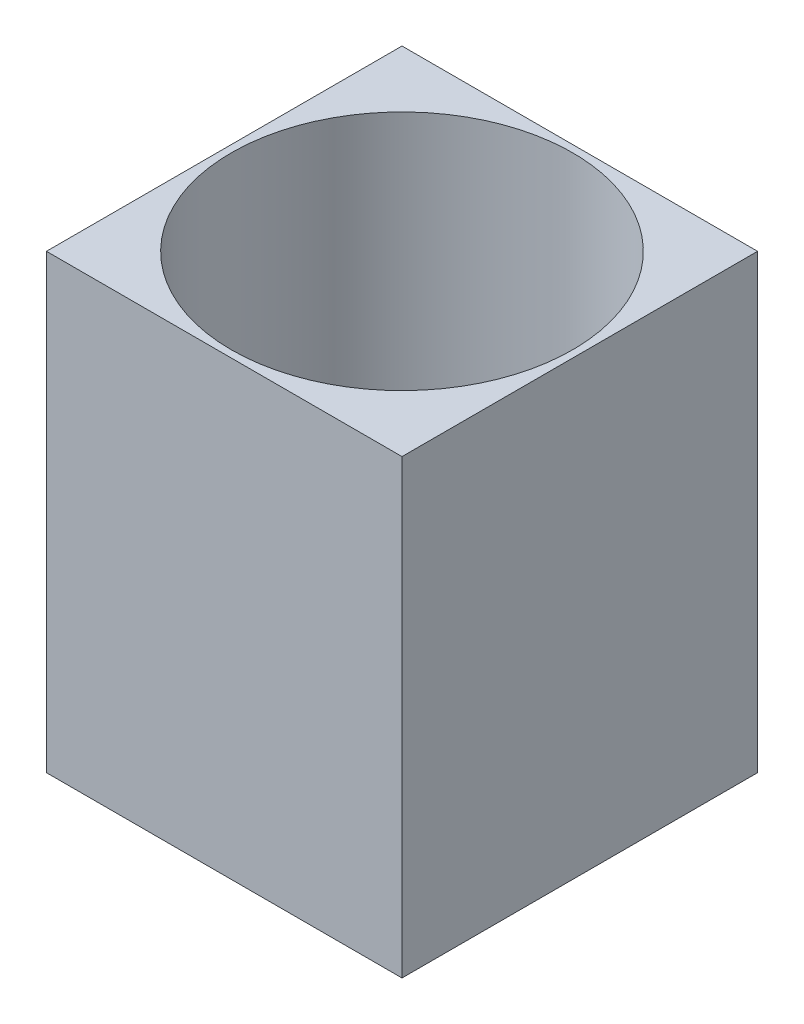
ISO-10303-21;
HEADER;
FILE_DESCRIPTION(('STEP AP214'),'2;1');
FILE_NAME('part.step','',(''),(''),'','','');
FILE_SCHEMA(('AUTOMOTIVE_DESIGN { 1 0 10303 214 1 1 1 1 }'));
ENDSEC;
DATA;
#1=APPLICATION_CONTEXT('core data for automotive mechanical design processes');
#2=APPLICATION_PROTOCOL_DEFINITION('international standard','automotive_design',2000,#1);
#3=PRODUCT_CONTEXT('',#1,'mechanical');
#4=PRODUCT('Part','Part','',(#3));
#5=PRODUCT_RELATED_PRODUCT_CATEGORY('part','',(#4));
#6=PRODUCT_DEFINITION_FORMATION('','',#4);
#7=PRODUCT_DEFINITION_CONTEXT('part definition',#1,'design');
#8=PRODUCT_DEFINITION('design','',#6,#7);
#9=PRODUCT_DEFINITION_SHAPE('','',#8);
#10=(LENGTH_UNIT() NAMED_UNIT(*) SI_UNIT(.MILLI.,.METRE.));
#11=(NAMED_UNIT(*) PLANE_ANGLE_UNIT() SI_UNIT($,.RADIAN.));
#12=(NAMED_UNIT(*) SI_UNIT($,.STERADIAN.) SOLID_ANGLE_UNIT());
#13=UNCERTAINTY_MEASURE_WITH_UNIT(LENGTH_MEASURE(1.E-05),#10,'distance_accuracy_value','');
#14=(GEOMETRIC_REPRESENTATION_CONTEXT(3) GLOBAL_UNCERTAINTY_ASSIGNED_CONTEXT((#13)) GLOBAL_UNIT_ASSIGNED_CONTEXT((#10,
#11,#12)) REPRESENTATION_CONTEXT('',''));
#15=CARTESIAN_POINT('',(0.,0.,0.));
#16=DIRECTION('',(0.,0.,1.));
#17=DIRECTION('',(1.,0.,0.));
#18=AXIS2_PLACEMENT_3D('',#15,#16,#17);
#19=CARTESIAN_POINT('',(0.,6.35,0.));
#20=DIRECTION('',(0.,-1.,0.));
#21=DIRECTION('',(0.,0.,-1.));
#22=AXIS2_PLACEMENT_3D('',#19,#20,#21);
#23=PLANE('',#22);
#24=DIRECTION('',(0.,0.,1.));
#25=VECTOR('',#24,1.);
#26=CARTESIAN_POINT('',(0.,6.35,0.));
#27=LINE('',#26,#25);
#28=CARTESIAN_POINT('',(0.,6.35,-5.));
#29=VERTEX_POINT('',#28);
#30=CARTESIAN_POINT('',(0.,6.35,0.));
#31=VERTEX_POINT('',#30);
#32=EDGE_CURVE('E95',#29,#31,#27,.T.);
#33=ORIENTED_EDGE('',*,*,#32,.T.);
#34=DIRECTION('',(1.,0.,0.));
#35=VECTOR('',#34,1.);
#36=CARTESIAN_POINT('',(0.,6.35,0.));
#37=LINE('',#36,#35);
#38=CARTESIAN_POINT('',(5.,6.35,0.));
#39=VERTEX_POINT('',#38);
#40=EDGE_CURVE('E90',#31,#39,#37,.T.);
#41=ORIENTED_EDGE('',*,*,#40,.T.);
#42=DIRECTION('',(0.,0.,-1.));
#43=VECTOR('',#42,1.);
#44=CARTESIAN_POINT('',(5.,6.35,0.));
#45=LINE('',#44,#43);
#46=CARTESIAN_POINT('',(5.,6.35,-5.));
#47=VERTEX_POINT('',#46);
#48=EDGE_CURVE('E93',#39,#47,#45,.T.);
#49=ORIENTED_EDGE('',*,*,#48,.T.);
#50=DIRECTION('',(-1.,0.,0.));
#51=VECTOR('',#50,1.);
#52=CARTESIAN_POINT('',(0.,6.35,-5.));
#53=LINE('',#52,#51);
#54=EDGE_CURVE('E60',#47,#29,#53,.T.);
#55=ORIENTED_EDGE('',*,*,#54,.T.);
#56=EDGE_LOOP('',(#33,#41,#49,#55));
#57=FACE_BOUND('',#56,.T.);
#58=CARTESIAN_POINT('',(2.5,6.35,-2.5));
#59=DIRECTION('',(0.,1.,0.));
#60=DIRECTION('',(0.,0.,1.));
#61=AXIS2_PLACEMENT_3D('',#58,#59,#60);
#62=CIRCLE('',#61,2.4);
#63=CARTESIAN_POINT('',(2.5,6.35,-0.1));
#64=VERTEX_POINT('',#63);
#65=EDGE_CURVE('E115',#64,#64,#62,.T.);
#66=ORIENTED_EDGE('',*,*,#65,.F.);
#67=EDGE_LOOP('',(#66));
#68=FACE_BOUND('',#67,.T.);
#69=ADVANCED_FACE('F42',(#57,#68),#23,.F.);
#70=CARTESIAN_POINT('',(0.,0.,0.));
#71=DIRECTION('',(0.,-1.,0.));
#72=DIRECTION('',(0.,0.,-1.));
#73=AXIS2_PLACEMENT_3D('',#70,#71,#72);
#74=PLANE('',#73);
#75=DIRECTION('',(0.,0.,1.));
#76=VECTOR('',#75,1.);
#77=CARTESIAN_POINT('',(0.,0.,0.));
#78=LINE('',#77,#76);
#79=CARTESIAN_POINT('',(0.,0.,-5.));
#80=VERTEX_POINT('',#79);
#81=CARTESIAN_POINT('',(0.,0.,0.));
#82=VERTEX_POINT('',#81);
#83=EDGE_CURVE('E111',#80,#82,#78,.T.);
#84=ORIENTED_EDGE('',*,*,#83,.F.);
#85=DIRECTION('',(-1.,0.,0.));
#86=VECTOR('',#85,1.);
#87=CARTESIAN_POINT('',(0.,0.,-5.));
#88=LINE('',#87,#86);
#89=CARTESIAN_POINT('',(5.,0.,-5.));
#90=VERTEX_POINT('',#89);
#91=EDGE_CURVE('E83',#90,#80,#88,.T.);
#92=ORIENTED_EDGE('',*,*,#91,.F.);
#93=DIRECTION('',(0.,0.,-1.));
#94=VECTOR('',#93,1.);
#95=CARTESIAN_POINT('',(5.,0.,0.));
#96=LINE('',#95,#94);
#97=CARTESIAN_POINT('',(5.,0.,0.));
#98=VERTEX_POINT('',#97);
#99=EDGE_CURVE('E77',#98,#90,#96,.T.);
#100=ORIENTED_EDGE('',*,*,#99,.F.);
#101=DIRECTION('',(1.,0.,0.));
#102=VECTOR('',#101,1.);
#103=CARTESIAN_POINT('',(0.,0.,0.));
#104=LINE('',#103,#102);
#105=EDGE_CURVE('E100',#82,#98,#104,.T.);
#106=ORIENTED_EDGE('',*,*,#105,.F.);
#107=EDGE_LOOP('',(#84,#92,#100,#106));
#108=FACE_BOUND('',#107,.T.);
#109=CARTESIAN_POINT('',(2.5,0.,-2.5));
#110=DIRECTION('',(0.,1.,0.));
#111=DIRECTION('',(0.,0.,1.));
#112=AXIS2_PLACEMENT_3D('',#109,#110,#111);
#113=CIRCLE('',#112,2.4);
#114=CARTESIAN_POINT('',(2.5,0.,-0.1));
#115=VERTEX_POINT('',#114);
#116=EDGE_CURVE('E133',#115,#115,#113,.T.);
#117=ORIENTED_EDGE('',*,*,#116,.T.);
#118=EDGE_LOOP('',(#117));
#119=FACE_BOUND('',#118,.T.);
#120=ADVANCED_FACE('F128',(#108,#119),#74,.T.);
#121=CARTESIAN_POINT('',(0.,6.35,0.));
#122=DIRECTION('',(1.,0.,0.));
#123=DIRECTION('',(0.,0.,-1.));
#124=AXIS2_PLACEMENT_3D('',#121,#122,#123);
#125=PLANE('',#124);
#126=ORIENTED_EDGE('',*,*,#83,.T.);
#127=DIRECTION('',(0.,-1.,0.));
#128=VECTOR('',#127,1.);
#129=CARTESIAN_POINT('',(0.,6.35,0.));
#130=LINE('',#129,#128);
#131=EDGE_CURVE('E11',#31,#82,#130,.T.);
#132=ORIENTED_EDGE('',*,*,#131,.F.);
#133=ORIENTED_EDGE('',*,*,#32,.F.);
#134=DIRECTION('',(0.,-1.,0.));
#135=VECTOR('',#134,1.);
#136=CARTESIAN_POINT('',(0.,6.35,-5.));
#137=LINE('',#136,#135);
#138=EDGE_CURVE('E107',#29,#80,#137,.T.);
#139=ORIENTED_EDGE('',*,*,#138,.T.);
#140=EDGE_LOOP('',(#126,#132,#133,#139));
#141=FACE_BOUND('',#140,.T.);
#142=ADVANCED_FACE('F44',(#141),#125,.F.);
#143=CARTESIAN_POINT('',(0.,6.35,0.));
#144=DIRECTION('',(0.,0.,-1.));
#145=DIRECTION('',(-1.,0.,0.));
#146=AXIS2_PLACEMENT_3D('',#143,#144,#145);
#147=PLANE('',#146);
#148=ORIENTED_EDGE('',*,*,#105,.T.);
#149=DIRECTION('',(0.,-1.,0.));
#150=VECTOR('',#149,1.);
#151=CARTESIAN_POINT('',(5.,6.35,0.));
#152=LINE('',#151,#150);
#153=EDGE_CURVE('E52',#39,#98,#152,.T.);
#154=ORIENTED_EDGE('',*,*,#153,.F.);
#155=ORIENTED_EDGE('',*,*,#40,.F.);
#156=ORIENTED_EDGE('',*,*,#131,.T.);
#157=EDGE_LOOP('',(#148,#154,#155,#156));
#158=FACE_BOUND('',#157,.T.);
#159=ADVANCED_FACE('F99',(#158),#147,.F.);
#160=CARTESIAN_POINT('',(5.,6.35,0.));
#161=DIRECTION('',(-1.,0.,0.));
#162=DIRECTION('',(0.,0.,1.));
#163=AXIS2_PLACEMENT_3D('',#160,#161,#162);
#164=PLANE('',#163);
#165=ORIENTED_EDGE('',*,*,#99,.T.);
#166=DIRECTION('',(0.,-1.,0.));
#167=VECTOR('',#166,1.);
#168=CARTESIAN_POINT('',(5.,6.35,-5.));
#169=LINE('',#168,#167);
#170=EDGE_CURVE('E102',#47,#90,#169,.T.);
#171=ORIENTED_EDGE('',*,*,#170,.F.);
#172=ORIENTED_EDGE('',*,*,#48,.F.);
#173=ORIENTED_EDGE('',*,*,#153,.T.);
#174=EDGE_LOOP('',(#165,#171,#172,#173));
#175=FACE_BOUND('',#174,.T.);
#176=ADVANCED_FACE('F103',(#175),#164,.F.);
#177=CARTESIAN_POINT('',(0.,6.35,-5.));
#178=DIRECTION('',(0.,0.,1.));
#179=DIRECTION('',(1.,0.,0.));
#180=AXIS2_PLACEMENT_3D('',#177,#178,#179);
#181=PLANE('',#180);
#182=ORIENTED_EDGE('',*,*,#91,.T.);
#183=ORIENTED_EDGE('',*,*,#138,.F.);
#184=ORIENTED_EDGE('',*,*,#54,.F.);
#185=ORIENTED_EDGE('',*,*,#170,.T.);
#186=EDGE_LOOP('',(#182,#183,#184,#185));
#187=FACE_BOUND('',#186,.T.);
#188=ADVANCED_FACE('F125',(#187),#181,.F.);
#189=CARTESIAN_POINT('',(2.5,6.35,-2.5));
#190=DIRECTION('',(0.,-1.,0.));
#191=DIRECTION('',(0.,0.,-1.));
#192=AXIS2_PLACEMENT_3D('',#189,#190,#191);
#193=CYLINDRICAL_SURFACE('',#192,2.4);
#194=ORIENTED_EDGE('',*,*,#65,.T.);
#195=EDGE_LOOP('',(#194));
#196=FACE_BOUND('',#195,.T.);
#197=ORIENTED_EDGE('',*,*,#116,.F.);
#198=EDGE_LOOP('',(#197));
#199=FACE_BOUND('',#198,.T.);
#200=ADVANCED_FACE('F141',(#196,#199),#193,.F.);
#201=CLOSED_SHELL('',(#69,#120,#142,#159,#176,#188,#200));
#202=MANIFOLD_SOLID_BREP('B2',#201);
#203=ADVANCED_BREP_SHAPE_REPRESENTATION('',(#18,#202),#14);
#204=SHAPE_DEFINITION_REPRESENTATION(#9,#203);
ENDSEC;
END-ISO-10303-21;
